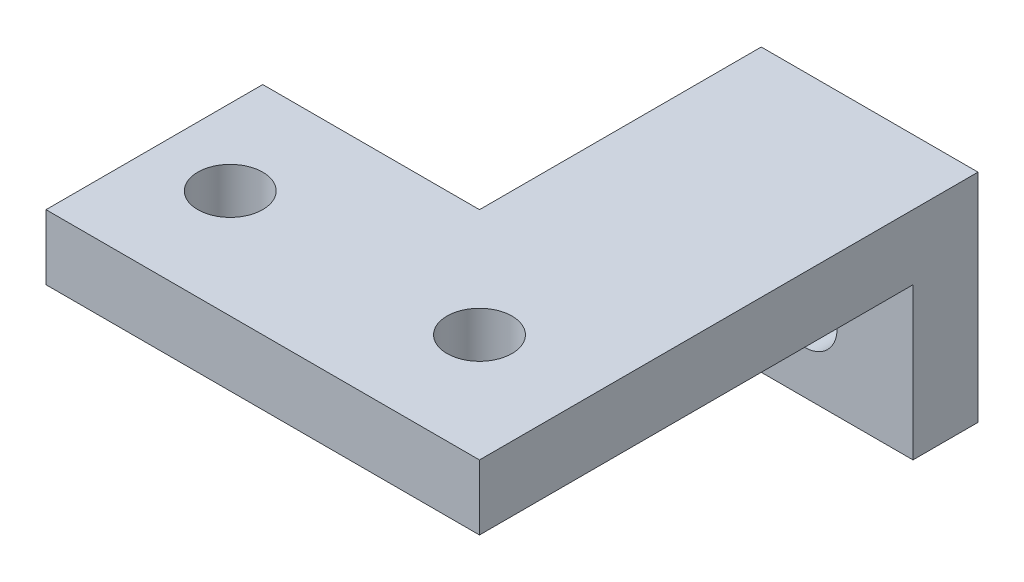
ISO-10303-21;
HEADER;
FILE_DESCRIPTION(('STEP AP214'),'2;1');
FILE_NAME('part.step','',(''),(''),'','','');
FILE_SCHEMA(('AUTOMOTIVE_DESIGN { 1 0 10303 214 1 1 1 1 }'));
ENDSEC;
DATA;
#1=APPLICATION_CONTEXT('core data for automotive mechanical design processes');
#2=APPLICATION_PROTOCOL_DEFINITION('international standard','automotive_design',2000,#1);
#3=PRODUCT_CONTEXT('',#1,'mechanical');
#4=PRODUCT('Part','Part','',(#3));
#5=PRODUCT_RELATED_PRODUCT_CATEGORY('part','',(#4));
#6=PRODUCT_DEFINITION_FORMATION('','',#4);
#7=PRODUCT_DEFINITION_CONTEXT('part definition',#1,'design');
#8=PRODUCT_DEFINITION('design','',#6,#7);
#9=PRODUCT_DEFINITION_SHAPE('','',#8);
#10=(LENGTH_UNIT() NAMED_UNIT(*) SI_UNIT(.MILLI.,.METRE.));
#11=(NAMED_UNIT(*) PLANE_ANGLE_UNIT() SI_UNIT($,.RADIAN.));
#12=(NAMED_UNIT(*) SI_UNIT($,.STERADIAN.) SOLID_ANGLE_UNIT());
#13=UNCERTAINTY_MEASURE_WITH_UNIT(LENGTH_MEASURE(1.E-05),#10,'distance_accuracy_value','');
#14=(GEOMETRIC_REPRESENTATION_CONTEXT(3) GLOBAL_UNCERTAINTY_ASSIGNED_CONTEXT((#13)) GLOBAL_UNIT_ASSIGNED_CONTEXT((#10,
#11,#12)) REPRESENTATION_CONTEXT('',''));
#15=CARTESIAN_POINT('',(0.,0.,0.));
#16=DIRECTION('',(0.,0.,1.));
#17=DIRECTION('',(1.,0.,0.));
#18=AXIS2_PLACEMENT_3D('',#15,#16,#17);
#19=CARTESIAN_POINT('',(0.,0.,0.));
#20=DIRECTION('',(0.,1.,0.));
#21=DIRECTION('',(0.,0.,1.));
#22=AXIS2_PLACEMENT_3D('',#19,#20,#21);
#23=PLANE('',#22);
#24=CARTESIAN_POINT('',(15.,0.,-5.));
#25=DIRECTION('',(0.,1.,0.));
#26=DIRECTION('',(0.,0.,1.));
#27=AXIS2_PLACEMENT_3D('',#24,#25,#26);
#28=CIRCLE('',#27,1.5);
#29=CARTESIAN_POINT('',(15.,0.,-3.5));
#30=VERTEX_POINT('',#29);
#31=EDGE_CURVE('E185',#30,#30,#28,.F.);
#32=ORIENTED_EDGE('',*,*,#31,.F.);
#33=EDGE_LOOP('',(#32));
#34=FACE_BOUND('',#33,.T.);
#35=CARTESIAN_POINT('',(3.5,0.,-5.));
#36=DIRECTION('',(0.,1.,0.));
#37=DIRECTION('',(0.,0.,1.));
#38=AXIS2_PLACEMENT_3D('',#35,#36,#37);
#39=CIRCLE('',#38,1.5);
#40=CARTESIAN_POINT('',(3.5,0.,-3.5));
#41=VERTEX_POINT('',#40);
#42=EDGE_CURVE('E188',#41,#41,#39,.F.);
#43=ORIENTED_EDGE('',*,*,#42,.F.);
#44=EDGE_LOOP('',(#43));
#45=FACE_BOUND('',#44,.T.);
#46=DIRECTION('',(-1.,0.,0.));
#47=VECTOR('',#46,1.);
#48=CARTESIAN_POINT('',(10.,0.,-20.));
#49=LINE('',#48,#47);
#50=CARTESIAN_POINT('',(20.,0.,-20.));
#51=VERTEX_POINT('',#50);
#52=CARTESIAN_POINT('',(10.,0.,-20.));
#53=VERTEX_POINT('',#52);
#54=EDGE_CURVE('E48',#51,#53,#49,.T.);
#55=ORIENTED_EDGE('',*,*,#54,.F.);
#56=DIRECTION('',(0.,0.,-1.));
#57=VECTOR('',#56,1.);
#58=CARTESIAN_POINT('',(20.,0.,0.));
#59=LINE('',#58,#57);
#60=CARTESIAN_POINT('',(20.,0.,0.));
#61=VERTEX_POINT('',#60);
#62=EDGE_CURVE('E128',#61,#51,#59,.T.);
#63=ORIENTED_EDGE('',*,*,#62,.F.);
#64=DIRECTION('',(1.,0.,0.));
#65=VECTOR('',#64,1.);
#66=CARTESIAN_POINT('',(0.,0.,0.));
#67=LINE('',#66,#65);
#68=CARTESIAN_POINT('',(0.,0.,0.));
#69=VERTEX_POINT('',#68);
#70=EDGE_CURVE('E79',#69,#61,#67,.T.);
#71=ORIENTED_EDGE('',*,*,#70,.F.);
#72=DIRECTION('',(0.,0.,1.));
#73=VECTOR('',#72,1.);
#74=CARTESIAN_POINT('',(0.,0.,-9.99999999999998));
#75=LINE('',#74,#73);
#76=CARTESIAN_POINT('',(0.,0.,-9.99999999999998));
#77=VERTEX_POINT('',#76);
#78=EDGE_CURVE('E111',#77,#69,#75,.T.);
#79=ORIENTED_EDGE('',*,*,#78,.F.);
#80=DIRECTION('',(-1.,0.,0.));
#81=VECTOR('',#80,1.);
#82=CARTESIAN_POINT('',(10.,0.,-9.99999999999994));
#83=LINE('',#82,#81);
#84=CARTESIAN_POINT('',(10.,0.,-9.99999999999994));
#85=VERTEX_POINT('',#84);
#86=EDGE_CURVE('E123',#85,#77,#83,.T.);
#87=ORIENTED_EDGE('',*,*,#86,.F.);
#88=DIRECTION('',(0.,0.,1.));
#89=VECTOR('',#88,1.);
#90=CARTESIAN_POINT('',(10.,0.,-23.));
#91=LINE('',#90,#89);
#92=EDGE_CURVE('E121',#53,#85,#91,.T.);
#93=ORIENTED_EDGE('',*,*,#92,.F.);
#94=EDGE_LOOP('',(#55,#63,#71,#79,#87,#93));
#95=FACE_BOUND('',#94,.T.);
#96=ADVANCED_FACE('F33',(#34,#45,#95),#23,.F.);
#97=CARTESIAN_POINT('',(20.,3.,-23.));
#98=DIRECTION('',(0.,0.,1.));
#99=DIRECTION('',(1.,0.,0.));
#100=AXIS2_PLACEMENT_3D('',#97,#98,#99);
#101=PLANE('',#100);
#102=CARTESIAN_POINT('',(15.,-3.5,-23.));
#103=DIRECTION('',(0.,0.,-1.));
#104=DIRECTION('',(-1.,0.,0.));
#105=AXIS2_PLACEMENT_3D('',#102,#103,#104);
#106=CIRCLE('',#105,1.5);
#107=CARTESIAN_POINT('',(13.5,-3.5,-23.));
#108=VERTEX_POINT('',#107);
#109=EDGE_CURVE('E180',#108,#108,#106,.T.);
#110=ORIENTED_EDGE('',*,*,#109,.F.);
#111=EDGE_LOOP('',(#110));
#112=FACE_BOUND('',#111,.T.);
#113=DIRECTION('',(0.,-1.,0.));
#114=VECTOR('',#113,1.);
#115=CARTESIAN_POINT('',(20.,3.,-23.));
#116=LINE('',#115,#114);
#117=CARTESIAN_POINT('',(20.,3.,-23.));
#118=VERTEX_POINT('',#117);
#119=CARTESIAN_POINT('',(20.,-7.,-23.));
#120=VERTEX_POINT('',#119);
#121=EDGE_CURVE('E117',#118,#120,#116,.T.);
#122=ORIENTED_EDGE('',*,*,#121,.T.);
#123=DIRECTION('',(1.,0.,0.));
#124=VECTOR('',#123,1.);
#125=CARTESIAN_POINT('',(10.,-7.,-23.));
#126=LINE('',#125,#124);
#127=CARTESIAN_POINT('',(10.,-7.,-23.));
#128=VERTEX_POINT('',#127);
#129=EDGE_CURVE('E154',#128,#120,#126,.T.);
#130=ORIENTED_EDGE('',*,*,#129,.F.);
#131=DIRECTION('',(0.,-1.,0.));
#132=VECTOR('',#131,1.);
#133=CARTESIAN_POINT('',(10.,3.,-23.));
#134=LINE('',#133,#132);
#135=CARTESIAN_POINT('',(10.,3.,-23.));
#136=VERTEX_POINT('',#135);
#137=EDGE_CURVE('E11',#136,#128,#134,.T.);
#138=ORIENTED_EDGE('',*,*,#137,.F.);
#139=DIRECTION('',(-1.,0.,0.));
#140=VECTOR('',#139,1.);
#141=CARTESIAN_POINT('',(20.,3.,-23.));
#142=LINE('',#141,#140);
#143=EDGE_CURVE('E130',#118,#136,#142,.T.);
#144=ORIENTED_EDGE('',*,*,#143,.F.);
#145=EDGE_LOOP('',(#122,#130,#138,#144));
#146=FACE_BOUND('',#145,.T.);
#147=ADVANCED_FACE('F35',(#112,#146),#101,.F.);
#148=CARTESIAN_POINT('',(10.,3.,-23.));
#149=DIRECTION('',(1.,0.,0.));
#150=DIRECTION('',(0.,0.,-1.));
#151=AXIS2_PLACEMENT_3D('',#148,#149,#150);
#152=PLANE('',#151);
#153=ORIENTED_EDGE('',*,*,#137,.T.);
#154=DIRECTION('',(0.,0.,-1.));
#155=VECTOR('',#154,1.);
#156=CARTESIAN_POINT('',(10.,-7.,-20.));
#157=LINE('',#156,#155);
#158=CARTESIAN_POINT('',(10.,-7.,-20.));
#159=VERTEX_POINT('',#158);
#160=EDGE_CURVE('E169',#159,#128,#157,.T.);
#161=ORIENTED_EDGE('',*,*,#160,.F.);
#162=DIRECTION('',(0.,1.,0.));
#163=VECTOR('',#162,1.);
#164=CARTESIAN_POINT('',(10.,-7.,-20.));
#165=LINE('',#164,#163);
#166=EDGE_CURVE('E152',#159,#53,#165,.T.);
#167=ORIENTED_EDGE('',*,*,#166,.T.);
#168=ORIENTED_EDGE('',*,*,#92,.T.);
#169=DIRECTION('',(0.,-1.,0.));
#170=VECTOR('',#169,1.);
#171=CARTESIAN_POINT('',(10.,3.,-9.99999999999994));
#172=LINE('',#171,#170);
#173=CARTESIAN_POINT('',(10.,3.,-9.99999999999994));
#174=VERTEX_POINT('',#173);
#175=EDGE_CURVE('E41',#174,#85,#172,.T.);
#176=ORIENTED_EDGE('',*,*,#175,.F.);
#177=DIRECTION('',(0.,0.,1.));
#178=VECTOR('',#177,1.);
#179=CARTESIAN_POINT('',(10.,3.,-23.));
#180=LINE('',#179,#178);
#181=EDGE_CURVE('E87',#136,#174,#180,.T.);
#182=ORIENTED_EDGE('',*,*,#181,.F.);
#183=EDGE_LOOP('',(#153,#161,#167,#168,#176,#182));
#184=FACE_BOUND('',#183,.T.);
#185=ADVANCED_FACE('F167',(#184),#152,.F.);
#186=CARTESIAN_POINT('',(10.,3.,-9.99999999999994));
#187=DIRECTION('',(0.,0.,1.));
#188=DIRECTION('',(1.,0.,0.));
#189=AXIS2_PLACEMENT_3D('',#186,#187,#188);
#190=PLANE('',#189);
#191=ORIENTED_EDGE('',*,*,#86,.T.);
#192=DIRECTION('',(0.,-1.,0.));
#193=VECTOR('',#192,1.);
#194=CARTESIAN_POINT('',(0.,3.,-9.99999999999998));
#195=LINE('',#194,#193);
#196=CARTESIAN_POINT('',(0.,3.,-9.99999999999998));
#197=VERTEX_POINT('',#196);
#198=EDGE_CURVE('E112',#197,#77,#195,.T.);
#199=ORIENTED_EDGE('',*,*,#198,.F.);
#200=DIRECTION('',(-1.,0.,0.));
#201=VECTOR('',#200,1.);
#202=CARTESIAN_POINT('',(10.,3.,-9.99999999999994));
#203=LINE('',#202,#201);
#204=EDGE_CURVE('E103',#174,#197,#203,.T.);
#205=ORIENTED_EDGE('',*,*,#204,.F.);
#206=ORIENTED_EDGE('',*,*,#175,.T.);
#207=EDGE_LOOP('',(#191,#199,#205,#206));
#208=FACE_BOUND('',#207,.T.);
#209=ADVANCED_FACE('F137',(#208),#190,.F.);
#210=CARTESIAN_POINT('',(0.,3.,-9.99999999999998));
#211=DIRECTION('',(1.,0.,0.));
#212=DIRECTION('',(0.,0.,-1.));
#213=AXIS2_PLACEMENT_3D('',#210,#211,#212);
#214=PLANE('',#213);
#215=ORIENTED_EDGE('',*,*,#78,.T.);
#216=DIRECTION('',(0.,-1.,0.));
#217=VECTOR('',#216,1.);
#218=CARTESIAN_POINT('',(0.,3.,0.));
#219=LINE('',#218,#217);
#220=CARTESIAN_POINT('',(0.,3.,0.));
#221=VERTEX_POINT('',#220);
#222=EDGE_CURVE('E108',#221,#69,#219,.T.);
#223=ORIENTED_EDGE('',*,*,#222,.F.);
#224=DIRECTION('',(0.,0.,1.));
#225=VECTOR('',#224,1.);
#226=CARTESIAN_POINT('',(0.,3.,-9.99999999999998));
#227=LINE('',#226,#225);
#228=EDGE_CURVE('E97',#197,#221,#227,.T.);
#229=ORIENTED_EDGE('',*,*,#228,.F.);
#230=ORIENTED_EDGE('',*,*,#198,.T.);
#231=EDGE_LOOP('',(#215,#223,#229,#230));
#232=FACE_BOUND('',#231,.T.);
#233=ADVANCED_FACE('F109',(#232),#214,.F.);
#234=CARTESIAN_POINT('',(0.,3.,0.));
#235=DIRECTION('',(0.,0.,-1.));
#236=DIRECTION('',(-1.,0.,0.));
#237=AXIS2_PLACEMENT_3D('',#234,#235,#236);
#238=PLANE('',#237);
#239=ORIENTED_EDGE('',*,*,#70,.T.);
#240=DIRECTION('',(0.,-1.,0.));
#241=VECTOR('',#240,1.);
#242=CARTESIAN_POINT('',(20.,3.,0.));
#243=LINE('',#242,#241);
#244=CARTESIAN_POINT('',(20.,3.,0.));
#245=VERTEX_POINT('',#244);
#246=EDGE_CURVE('E113',#245,#61,#243,.T.);
#247=ORIENTED_EDGE('',*,*,#246,.F.);
#248=DIRECTION('',(1.,0.,0.));
#249=VECTOR('',#248,1.);
#250=CARTESIAN_POINT('',(0.,3.,0.));
#251=LINE('',#250,#249);
#252=EDGE_CURVE('E101',#221,#245,#251,.T.);
#253=ORIENTED_EDGE('',*,*,#252,.F.);
#254=ORIENTED_EDGE('',*,*,#222,.T.);
#255=EDGE_LOOP('',(#239,#247,#253,#254));
#256=FACE_BOUND('',#255,.T.);
#257=ADVANCED_FACE('F115',(#256),#238,.F.);
#258=CARTESIAN_POINT('',(20.,3.,0.));
#259=DIRECTION('',(-1.,0.,0.));
#260=DIRECTION('',(0.,0.,1.));
#261=AXIS2_PLACEMENT_3D('',#258,#259,#260);
#262=PLANE('',#261);
#263=ORIENTED_EDGE('',*,*,#62,.T.);
#264=DIRECTION('',(0.,1.,0.));
#265=VECTOR('',#264,1.);
#266=CARTESIAN_POINT('',(20.,-7.,-20.));
#267=LINE('',#266,#265);
#268=CARTESIAN_POINT('',(20.,-7.,-20.));
#269=VERTEX_POINT('',#268);
#270=EDGE_CURVE('E124',#269,#51,#267,.T.);
#271=ORIENTED_EDGE('',*,*,#270,.F.);
#272=DIRECTION('',(0.,0.,1.));
#273=VECTOR('',#272,1.);
#274=CARTESIAN_POINT('',(20.,-7.,-20.));
#275=LINE('',#274,#273);
#276=EDGE_CURVE('E175',#120,#269,#275,.T.);
#277=ORIENTED_EDGE('',*,*,#276,.F.);
#278=ORIENTED_EDGE('',*,*,#121,.F.);
#279=DIRECTION('',(0.,0.,-1.));
#280=VECTOR('',#279,1.);
#281=CARTESIAN_POINT('',(20.,3.,0.));
#282=LINE('',#281,#280);
#283=EDGE_CURVE('E57',#245,#118,#282,.T.);
#284=ORIENTED_EDGE('',*,*,#283,.F.);
#285=ORIENTED_EDGE('',*,*,#246,.T.);
#286=EDGE_LOOP('',(#263,#271,#277,#278,#284,#285));
#287=FACE_BOUND('',#286,.T.);
#288=ADVANCED_FACE('F141',(#287),#262,.F.);
#289=CARTESIAN_POINT('',(0.,3.,0.));
#290=DIRECTION('',(0.,1.,0.));
#291=DIRECTION('',(0.,0.,1.));
#292=AXIS2_PLACEMENT_3D('',#289,#290,#291);
#293=PLANE('',#292);
#294=CARTESIAN_POINT('',(15.,3.,-5.));
#295=DIRECTION('',(0.,1.,0.));
#296=DIRECTION('',(0.,0.,1.));
#297=AXIS2_PLACEMENT_3D('',#294,#295,#296);
#298=CIRCLE('',#297,1.5);
#299=CARTESIAN_POINT('',(15.,3.,-3.5));
#300=VERTEX_POINT('',#299);
#301=EDGE_CURVE('E191',#300,#300,#298,.T.);
#302=ORIENTED_EDGE('',*,*,#301,.F.);
#303=EDGE_LOOP('',(#302));
#304=FACE_BOUND('',#303,.T.);
#305=CARTESIAN_POINT('',(3.5,3.,-5.));
#306=DIRECTION('',(0.,1.,0.));
#307=DIRECTION('',(0.,0.,1.));
#308=AXIS2_PLACEMENT_3D('',#305,#306,#307);
#309=CIRCLE('',#308,1.5);
#310=CARTESIAN_POINT('',(3.5,3.,-3.5));
#311=VERTEX_POINT('',#310);
#312=EDGE_CURVE('E192',#311,#311,#309,.T.);
#313=ORIENTED_EDGE('',*,*,#312,.F.);
#314=EDGE_LOOP('',(#313));
#315=FACE_BOUND('',#314,.T.);
#316=ORIENTED_EDGE('',*,*,#143,.T.);
#317=ORIENTED_EDGE('',*,*,#181,.T.);
#318=ORIENTED_EDGE('',*,*,#204,.T.);
#319=ORIENTED_EDGE('',*,*,#228,.T.);
#320=ORIENTED_EDGE('',*,*,#252,.T.);
#321=ORIENTED_EDGE('',*,*,#283,.T.);
#322=EDGE_LOOP('',(#316,#317,#318,#319,#320,#321));
#323=FACE_BOUND('',#322,.T.);
#324=ADVANCED_FACE('F99',(#304,#315,#323),#293,.T.);
#325=CARTESIAN_POINT('',(10.,-7.,-20.));
#326=DIRECTION('',(0.,0.,-1.));
#327=DIRECTION('',(-1.,0.,0.));
#328=AXIS2_PLACEMENT_3D('',#325,#326,#327);
#329=PLANE('',#328);
#330=CARTESIAN_POINT('',(15.,-3.5,-20.));
#331=DIRECTION('',(0.,0.,-1.));
#332=DIRECTION('',(-1.,0.,0.));
#333=AXIS2_PLACEMENT_3D('',#330,#331,#332);
#334=CIRCLE('',#333,1.5);
#335=CARTESIAN_POINT('',(13.5,-3.5,-20.));
#336=VERTEX_POINT('',#335);
#337=EDGE_CURVE('E178',#336,#336,#334,.F.);
#338=ORIENTED_EDGE('',*,*,#337,.F.);
#339=EDGE_LOOP('',(#338));
#340=FACE_BOUND('',#339,.T.);
#341=ORIENTED_EDGE('',*,*,#54,.T.);
#342=ORIENTED_EDGE('',*,*,#166,.F.);
#343=DIRECTION('',(-1.,0.,0.));
#344=VECTOR('',#343,1.);
#345=CARTESIAN_POINT('',(10.,-7.,-20.));
#346=LINE('',#345,#344);
#347=EDGE_CURVE('E150',#269,#159,#346,.T.);
#348=ORIENTED_EDGE('',*,*,#347,.F.);
#349=ORIENTED_EDGE('',*,*,#270,.T.);
#350=EDGE_LOOP('',(#341,#342,#348,#349));
#351=FACE_BOUND('',#350,.T.);
#352=ADVANCED_FACE('F146',(#340,#351),#329,.F.);
#353=CARTESIAN_POINT('',(0.,-7.,0.));
#354=DIRECTION('',(0.,-1.,0.));
#355=DIRECTION('',(0.,0.,-1.));
#356=AXIS2_PLACEMENT_3D('',#353,#354,#355);
#357=PLANE('',#356);
#358=ORIENTED_EDGE('',*,*,#276,.T.);
#359=ORIENTED_EDGE('',*,*,#347,.T.);
#360=ORIENTED_EDGE('',*,*,#160,.T.);
#361=ORIENTED_EDGE('',*,*,#129,.T.);
#362=EDGE_LOOP('',(#358,#359,#360,#361));
#363=FACE_BOUND('',#362,.T.);
#364=ADVANCED_FACE('F172',(#363),#357,.T.);
#365=CARTESIAN_POINT('',(15.,-3.5,0.001000000000001));
#366=DIRECTION('',(0.,0.,-1.));
#367=DIRECTION('',(-1.,0.,0.));
#368=AXIS2_PLACEMENT_3D('',#365,#366,#367);
#369=CYLINDRICAL_SURFACE('',#368,1.5);
#370=ORIENTED_EDGE('',*,*,#109,.T.);
#371=EDGE_LOOP('',(#370));
#372=FACE_BOUND('',#371,.T.);
#373=ORIENTED_EDGE('',*,*,#337,.T.);
#374=EDGE_LOOP('',(#373));
#375=FACE_BOUND('',#374,.T.);
#376=ADVANCED_FACE('F211',(#372,#375),#369,.F.);
#377=CARTESIAN_POINT('',(3.5,-7.001,-5.));
#378=DIRECTION('',(0.,1.,0.));
#379=DIRECTION('',(0.,0.,1.));
#380=AXIS2_PLACEMENT_3D('',#377,#378,#379);
#381=CYLINDRICAL_SURFACE('',#380,1.5);
#382=ORIENTED_EDGE('',*,*,#312,.T.);
#383=EDGE_LOOP('',(#382));
#384=FACE_BOUND('',#383,.T.);
#385=ORIENTED_EDGE('',*,*,#42,.T.);
#386=EDGE_LOOP('',(#385));
#387=FACE_BOUND('',#386,.T.);
#388=ADVANCED_FACE('F208',(#384,#387),#381,.F.);
#389=CARTESIAN_POINT('',(15.,-7.001,-5.));
#390=DIRECTION('',(0.,1.,0.));
#391=DIRECTION('',(0.,0.,1.));
#392=AXIS2_PLACEMENT_3D('',#389,#390,#391);
#393=CYLINDRICAL_SURFACE('',#392,1.5);
#394=ORIENTED_EDGE('',*,*,#301,.T.);
#395=EDGE_LOOP('',(#394));
#396=FACE_BOUND('',#395,.T.);
#397=ORIENTED_EDGE('',*,*,#31,.T.);
#398=EDGE_LOOP('',(#397));
#399=FACE_BOUND('',#398,.T.);
#400=ADVANCED_FACE('F200',(#396,#399),#393,.F.);
#401=CLOSED_SHELL('',(#96,#147,#185,#209,#233,#257,#288,#324,#352,#364,#376,#388,#400));
#402=MANIFOLD_SOLID_BREP('B2',#401);
#403=ADVANCED_BREP_SHAPE_REPRESENTATION('',(#18,#402),#14);
#404=SHAPE_DEFINITION_REPRESENTATION(#9,#403);
ENDSEC;
END-ISO-10303-21;
